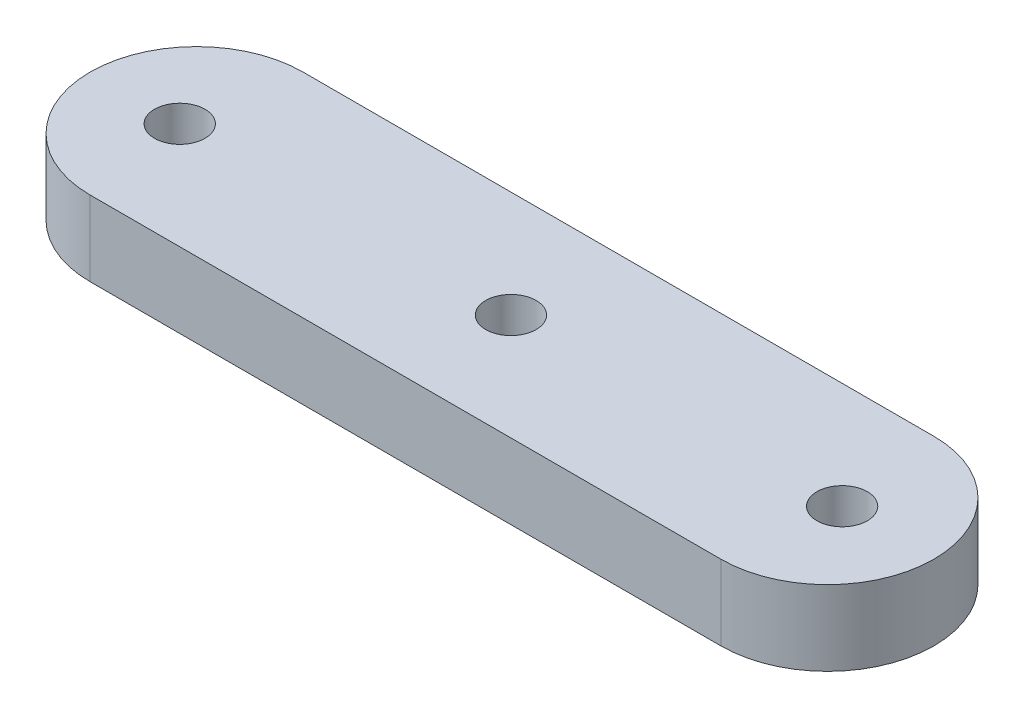
ISO-10303-21;
HEADER;
FILE_DESCRIPTION(('STEP AP214'),'2;1');
FILE_NAME('part.step','',(''),(''),'','','');
FILE_SCHEMA(('AUTOMOTIVE_DESIGN { 1 0 10303 214 1 1 1 1 }'));
ENDSEC;
DATA;
#1=APPLICATION_CONTEXT('core data for automotive mechanical design processes');
#2=APPLICATION_PROTOCOL_DEFINITION('international standard','automotive_design',2000,#1);
#3=PRODUCT_CONTEXT('',#1,'mechanical');
#4=PRODUCT('Part','Part','',(#3));
#5=PRODUCT_RELATED_PRODUCT_CATEGORY('part','',(#4));
#6=PRODUCT_DEFINITION_FORMATION('','',#4);
#7=PRODUCT_DEFINITION_CONTEXT('part definition',#1,'design');
#8=PRODUCT_DEFINITION('design','',#6,#7);
#9=PRODUCT_DEFINITION_SHAPE('','',#8);
#10=(LENGTH_UNIT() NAMED_UNIT(*) SI_UNIT(.MILLI.,.METRE.));
#11=(NAMED_UNIT(*) PLANE_ANGLE_UNIT() SI_UNIT($,.RADIAN.));
#12=(NAMED_UNIT(*) SI_UNIT($,.STERADIAN.) SOLID_ANGLE_UNIT());
#13=UNCERTAINTY_MEASURE_WITH_UNIT(LENGTH_MEASURE(1.E-05),#10,'distance_accuracy_value','');
#14=(GEOMETRIC_REPRESENTATION_CONTEXT(3) GLOBAL_UNCERTAINTY_ASSIGNED_CONTEXT((#13)) GLOBAL_UNIT_ASSIGNED_CONTEXT((#10,
#11,#12)) REPRESENTATION_CONTEXT('',''));
#15=CARTESIAN_POINT('',(0.,0.,0.));
#16=DIRECTION('',(0.,0.,1.));
#17=DIRECTION('',(1.,0.,0.));
#18=AXIS2_PLACEMENT_3D('',#15,#16,#17);
#19=CARTESIAN_POINT('',(-19.9322257855409,4.763,0.));
#20=DIRECTION('',(0.,-1.,0.));
#21=DIRECTION('',(0.,0.,-1.));
#22=AXIS2_PLACEMENT_3D('',#19,#20,#21);
#23=CYLINDRICAL_SURFACE('',#22,6.7509368544637);
#24=CARTESIAN_POINT('',(-19.9322257855409,0.,0.));
#25=DIRECTION('',(0.,1.,0.));
#26=DIRECTION('',(0.,0.,1.));
#27=AXIS2_PLACEMENT_3D('',#24,#25,#26);
#28=CIRCLE('',#27,6.7509368544637);
#29=CARTESIAN_POINT('',(-19.9322257855409,0.,-6.7509368544637));
#30=VERTEX_POINT('',#29);
#31=CARTESIAN_POINT('',(-19.9322257855409,0.,6.7509368544637));
#32=VERTEX_POINT('',#31);
#33=EDGE_CURVE('E107',#30,#32,#28,.T.);
#34=ORIENTED_EDGE('',*,*,#33,.T.);
#35=DIRECTION('',(0.,-1.,0.));
#36=VECTOR('',#35,1.);
#37=CARTESIAN_POINT('',(-19.9322257855409,4.763,6.7509368544637));
#38=LINE('',#37,#36);
#39=CARTESIAN_POINT('',(-19.9322257855409,4.763,6.7509368544637));
#40=VERTEX_POINT('',#39);
#41=EDGE_CURVE('E12',#40,#32,#38,.T.);
#42=ORIENTED_EDGE('',*,*,#41,.F.);
#43=CARTESIAN_POINT('',(-19.9322257855409,4.763,0.));
#44=DIRECTION('',(0.,1.,0.));
#45=DIRECTION('',(0.,0.,1.));
#46=AXIS2_PLACEMENT_3D('',#43,#44,#45);
#47=CIRCLE('',#46,6.7509368544637);
#48=CARTESIAN_POINT('',(-19.9322257855409,4.763,-6.7509368544637));
#49=VERTEX_POINT('',#48);
#50=EDGE_CURVE('E95',#49,#40,#47,.T.);
#51=ORIENTED_EDGE('',*,*,#50,.F.);
#52=DIRECTION('',(0.,-1.,0.));
#53=VECTOR('',#52,1.);
#54=CARTESIAN_POINT('',(-19.9322257855409,4.763,-6.7509368544637));
#55=LINE('',#54,#53);
#56=EDGE_CURVE('E103',#49,#30,#55,.T.);
#57=ORIENTED_EDGE('',*,*,#56,.T.);
#58=EDGE_LOOP('',(#34,#42,#51,#57));
#59=FACE_BOUND('',#58,.T.);
#60=ADVANCED_FACE('F44',(#59),#23,.T.);
#61=CARTESIAN_POINT('',(-19.9322257855409,4.763,6.7509368544637));
#62=DIRECTION('',(0.,0.,-1.));
#63=DIRECTION('',(-1.,0.,0.));
#64=AXIS2_PLACEMENT_3D('',#61,#62,#63);
#65=PLANE('',#64);
#66=DIRECTION('',(1.,0.,0.));
#67=VECTOR('',#66,1.);
#68=CARTESIAN_POINT('',(-19.9322257855409,0.,6.7509368544637));
#69=LINE('',#68,#67);
#70=CARTESIAN_POINT('',(20.0677742144591,0.,6.75093685446369));
#71=VERTEX_POINT('',#70);
#72=EDGE_CURVE('E99',#32,#71,#69,.T.);
#73=ORIENTED_EDGE('',*,*,#72,.T.);
#74=DIRECTION('',(0.,-1.,0.));
#75=VECTOR('',#74,1.);
#76=CARTESIAN_POINT('',(20.0677742144591,4.763,6.75093685446369));
#77=LINE('',#76,#75);
#78=CARTESIAN_POINT('',(20.0677742144591,4.763,6.75093685446369));
#79=VERTEX_POINT('',#78);
#80=EDGE_CURVE('E52',#79,#71,#77,.T.);
#81=ORIENTED_EDGE('',*,*,#80,.F.);
#82=DIRECTION('',(1.,0.,0.));
#83=VECTOR('',#82,1.);
#84=CARTESIAN_POINT('',(-19.9322257855409,4.763,6.7509368544637));
#85=LINE('',#84,#83);
#86=EDGE_CURVE('E90',#40,#79,#85,.T.);
#87=ORIENTED_EDGE('',*,*,#86,.F.);
#88=ORIENTED_EDGE('',*,*,#41,.T.);
#89=EDGE_LOOP('',(#73,#81,#87,#88));
#90=FACE_BOUND('',#89,.T.);
#91=ADVANCED_FACE('F98',(#90),#65,.F.);
#92=CARTESIAN_POINT('',(20.0677742144591,4.763,0.));
#93=DIRECTION('',(0.,-1.,0.));
#94=DIRECTION('',(0.,0.,-1.));
#95=AXIS2_PLACEMENT_3D('',#92,#93,#94);
#96=CYLINDRICAL_SURFACE('',#95,6.7509368544637);
#97=CARTESIAN_POINT('',(20.0677742144591,0.,0.));
#98=DIRECTION('',(0.,1.,0.));
#99=DIRECTION('',(0.,0.,1.));
#100=AXIS2_PLACEMENT_3D('',#97,#98,#99);
#101=CIRCLE('',#100,6.7509368544637);
#102=CARTESIAN_POINT('',(20.0677742144591,0.,-6.75093685446371));
#103=VERTEX_POINT('',#102);
#104=EDGE_CURVE('E77',#71,#103,#101,.T.);
#105=ORIENTED_EDGE('',*,*,#104,.T.);
#106=DIRECTION('',(0.,-1.,0.));
#107=VECTOR('',#106,1.);
#108=CARTESIAN_POINT('',(20.0677742144591,4.763,-6.75093685446371));
#109=LINE('',#108,#107);
#110=CARTESIAN_POINT('',(20.0677742144591,4.763,-6.75093685446371));
#111=VERTEX_POINT('',#110);
#112=EDGE_CURVE('E100',#111,#103,#109,.T.);
#113=ORIENTED_EDGE('',*,*,#112,.F.);
#114=CARTESIAN_POINT('',(20.0677742144591,4.763,0.));
#115=DIRECTION('',(0.,1.,0.));
#116=DIRECTION('',(0.,0.,1.));
#117=AXIS2_PLACEMENT_3D('',#114,#115,#116);
#118=CIRCLE('',#117,6.7509368544637);
#119=EDGE_CURVE('E93',#79,#111,#118,.T.);
#120=ORIENTED_EDGE('',*,*,#119,.F.);
#121=ORIENTED_EDGE('',*,*,#80,.T.);
#122=EDGE_LOOP('',(#105,#113,#120,#121));
#123=FACE_BOUND('',#122,.T.);
#124=ADVANCED_FACE('F101',(#123),#96,.T.);
#125=CARTESIAN_POINT('',(-19.9322257855409,4.763,-6.7509368544637));
#126=DIRECTION('',(0.,0.,1.));
#127=DIRECTION('',(1.,0.,0.));
#128=AXIS2_PLACEMENT_3D('',#125,#126,#127);
#129=PLANE('',#128);
#130=DIRECTION('',(-1.,0.,0.));
#131=VECTOR('',#130,1.);
#132=CARTESIAN_POINT('',(-19.9322257855409,0.,-6.7509368544637));
#133=LINE('',#132,#131);
#134=EDGE_CURVE('E83',#103,#30,#133,.T.);
#135=ORIENTED_EDGE('',*,*,#134,.T.);
#136=ORIENTED_EDGE('',*,*,#56,.F.);
#137=DIRECTION('',(-1.,0.,0.));
#138=VECTOR('',#137,1.);
#139=CARTESIAN_POINT('',(-19.9322257855409,4.763,-6.7509368544637));
#140=LINE('',#139,#138);
#141=EDGE_CURVE('E60',#111,#49,#140,.T.);
#142=ORIENTED_EDGE('',*,*,#141,.F.);
#143=ORIENTED_EDGE('',*,*,#112,.T.);
#144=EDGE_LOOP('',(#135,#136,#142,#143));
#145=FACE_BOUND('',#144,.T.);
#146=ADVANCED_FACE('F129',(#145),#129,.F.);
#147=CARTESIAN_POINT('',(-19.9322257855409,4.763,0.));
#148=DIRECTION('',(0.,1.,0.));
#149=DIRECTION('',(0.,0.,1.));
#150=AXIS2_PLACEMENT_3D('',#147,#148,#149);
#151=PLANE('',#150);
#152=CARTESIAN_POINT('',(-21.,4.763,0.));
#153=DIRECTION('',(0.,1.,0.));
#154=DIRECTION('',(0.,0.,1.));
#155=AXIS2_PLACEMENT_3D('',#152,#153,#154);
#156=CIRCLE('',#155,1.6);
#157=CARTESIAN_POINT('',(-21.,4.763,1.59999999999999));
#158=VERTEX_POINT('',#157);
#159=EDGE_CURVE('E266',#158,#158,#156,.T.);
#160=ORIENTED_EDGE('',*,*,#159,.F.);
#161=EDGE_LOOP('',(#160));
#162=FACE_BOUND('',#161,.T.);
#163=CARTESIAN_POINT('',(0.,4.763,0.));
#164=DIRECTION('',(0.,1.,0.));
#165=DIRECTION('',(0.,0.,1.));
#166=AXIS2_PLACEMENT_3D('',#163,#164,#165);
#167=CIRCLE('',#166,1.6);
#168=CARTESIAN_POINT('',(0.,4.763,1.6));
#169=VERTEX_POINT('',#168);
#170=EDGE_CURVE('E259',#169,#169,#167,.T.);
#171=ORIENTED_EDGE('',*,*,#170,.F.);
#172=EDGE_LOOP('',(#171));
#173=FACE_BOUND('',#172,.T.);
#174=CARTESIAN_POINT('',(21.,4.763,0.));
#175=DIRECTION('',(0.,1.,0.));
#176=DIRECTION('',(0.,0.,1.));
#177=AXIS2_PLACEMENT_3D('',#174,#175,#176);
#178=CIRCLE('',#177,1.6);
#179=CARTESIAN_POINT('',(21.,4.763,1.59999999999999));
#180=VERTEX_POINT('',#179);
#181=EDGE_CURVE('E139',#180,#180,#178,.T.);
#182=ORIENTED_EDGE('',*,*,#181,.F.);
#183=EDGE_LOOP('',(#182));
#184=FACE_BOUND('',#183,.T.);
#185=ORIENTED_EDGE('',*,*,#50,.T.);
#186=ORIENTED_EDGE('',*,*,#86,.T.);
#187=ORIENTED_EDGE('',*,*,#119,.T.);
#188=ORIENTED_EDGE('',*,*,#141,.T.);
#189=EDGE_LOOP('',(#185,#186,#187,#188));
#190=FACE_BOUND('',#189,.T.);
#191=ADVANCED_FACE('F91',(#162,#173,#184,#190),#151,.T.);
#192=CARTESIAN_POINT('',(-19.9322257855409,0.,0.));
#193=DIRECTION('',(0.,1.,0.));
#194=DIRECTION('',(0.,0.,1.));
#195=AXIS2_PLACEMENT_3D('',#192,#193,#194);
#196=PLANE('',#195);
#197=CARTESIAN_POINT('',(-21.,0.,0.));
#198=DIRECTION('',(0.,1.,0.));
#199=DIRECTION('',(0.,0.,1.));
#200=AXIS2_PLACEMENT_3D('',#197,#198,#199);
#201=CIRCLE('',#200,1.6);
#202=CARTESIAN_POINT('',(-21.,0.,1.59999999999999));
#203=VERTEX_POINT('',#202);
#204=EDGE_CURVE('E261',#203,#203,#201,.T.);
#205=ORIENTED_EDGE('',*,*,#204,.T.);
#206=EDGE_LOOP('',(#205));
#207=FACE_BOUND('',#206,.T.);
#208=CARTESIAN_POINT('',(0.,0.,0.));
#209=DIRECTION('',(0.,1.,0.));
#210=DIRECTION('',(0.,0.,1.));
#211=AXIS2_PLACEMENT_3D('',#208,#209,#210);
#212=CIRCLE('',#211,1.6);
#213=CARTESIAN_POINT('',(0.,0.,1.6));
#214=VERTEX_POINT('',#213);
#215=EDGE_CURVE('E254',#214,#214,#212,.T.);
#216=ORIENTED_EDGE('',*,*,#215,.T.);
#217=EDGE_LOOP('',(#216));
#218=FACE_BOUND('',#217,.T.);
#219=CARTESIAN_POINT('',(21.,0.,0.));
#220=DIRECTION('',(0.,1.,0.));
#221=DIRECTION('',(0.,0.,1.));
#222=AXIS2_PLACEMENT_3D('',#219,#220,#221);
#223=CIRCLE('',#222,1.6);
#224=CARTESIAN_POINT('',(21.,0.,1.59999999999999));
#225=VERTEX_POINT('',#224);
#226=EDGE_CURVE('E112',#225,#225,#223,.T.);
#227=ORIENTED_EDGE('',*,*,#226,.T.);
#228=EDGE_LOOP('',(#227));
#229=FACE_BOUND('',#228,.T.);
#230=ORIENTED_EDGE('',*,*,#33,.F.);
#231=ORIENTED_EDGE('',*,*,#134,.F.);
#232=ORIENTED_EDGE('',*,*,#104,.F.);
#233=ORIENTED_EDGE('',*,*,#72,.F.);
#234=EDGE_LOOP('',(#230,#231,#232,#233));
#235=FACE_BOUND('',#234,.T.);
#236=ADVANCED_FACE('F132',(#207,#218,#229,#235),#196,.F.);
#237=CARTESIAN_POINT('',(21.,4.763,0.));
#238=DIRECTION('',(0.,1.,0.));
#239=DIRECTION('',(0.,0.,1.));
#240=AXIS2_PLACEMENT_3D('',#237,#238,#239);
#241=CYLINDRICAL_SURFACE('',#240,1.6);
#242=ORIENTED_EDGE('',*,*,#226,.F.);
#243=EDGE_LOOP('',(#242));
#244=FACE_BOUND('',#243,.T.);
#245=ORIENTED_EDGE('',*,*,#181,.T.);
#246=EDGE_LOOP('',(#245));
#247=FACE_BOUND('',#246,.T.);
#248=ADVANCED_FACE('F280',(#244,#247),#241,.F.);
#249=CARTESIAN_POINT('',(0.,4.763,0.));
#250=DIRECTION('',(0.,1.,0.));
#251=DIRECTION('',(0.,0.,1.));
#252=AXIS2_PLACEMENT_3D('',#249,#250,#251);
#253=CYLINDRICAL_SURFACE('',#252,1.6);
#254=ORIENTED_EDGE('',*,*,#215,.F.);
#255=EDGE_LOOP('',(#254));
#256=FACE_BOUND('',#255,.T.);
#257=ORIENTED_EDGE('',*,*,#170,.T.);
#258=EDGE_LOOP('',(#257));
#259=FACE_BOUND('',#258,.T.);
#260=ADVANCED_FACE('F282',(#256,#259),#253,.F.);
#261=CARTESIAN_POINT('',(-21.,4.763,0.));
#262=DIRECTION('',(0.,1.,0.));
#263=DIRECTION('',(0.,0.,1.));
#264=AXIS2_PLACEMENT_3D('',#261,#262,#263);
#265=CYLINDRICAL_SURFACE('',#264,1.6);
#266=ORIENTED_EDGE('',*,*,#204,.F.);
#267=EDGE_LOOP('',(#266));
#268=FACE_BOUND('',#267,.T.);
#269=ORIENTED_EDGE('',*,*,#159,.T.);
#270=EDGE_LOOP('',(#269));
#271=FACE_BOUND('',#270,.T.);
#272=ADVANCED_FACE('F270',(#268,#271),#265,.F.);
#273=CLOSED_SHELL('',(#60,#91,#124,#146,#191,#236,#248,#260,#272));
#274=MANIFOLD_SOLID_BREP('B2',#273);
#275=ADVANCED_BREP_SHAPE_REPRESENTATION('',(#18,#274),#14);
#276=SHAPE_DEFINITION_REPRESENTATION(#9,#275);
ENDSEC;
END-ISO-10303-21;
